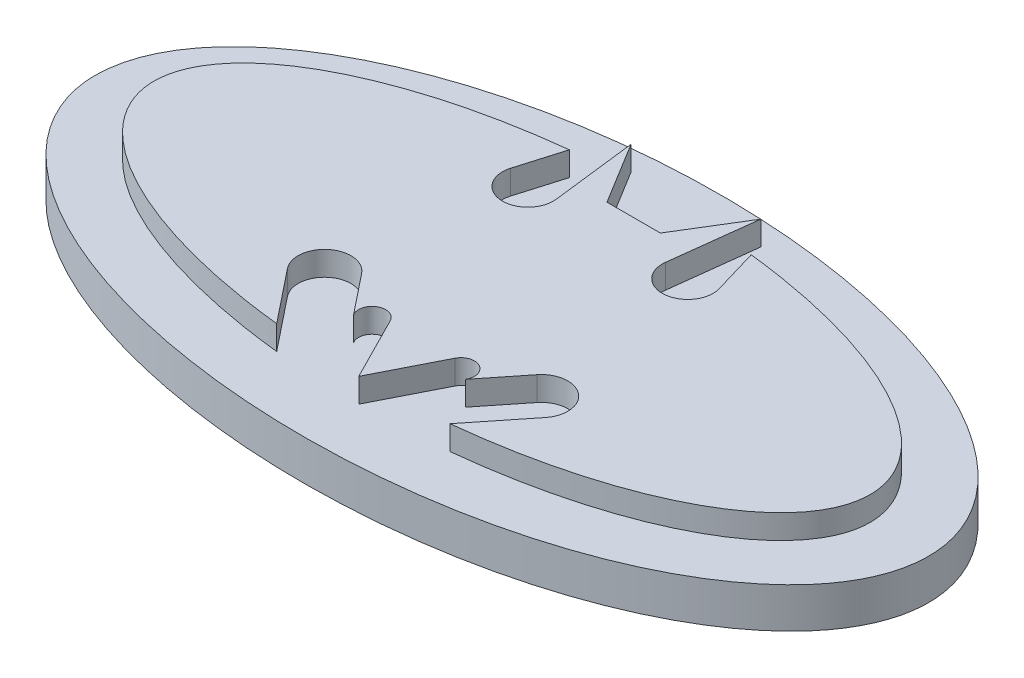
ISO-10303-21;
HEADER;
FILE_DESCRIPTION(('STEP AP214'),'2;1');
FILE_NAME('part.step','',(''),(''),'','','');
FILE_SCHEMA(('AUTOMOTIVE_DESIGN { 1 0 10303 214 1 1 1 1 }'));
ENDSEC;
DATA;
#1=APPLICATION_CONTEXT('core data for automotive mechanical design processes');
#2=APPLICATION_PROTOCOL_DEFINITION('international standard','automotive_design',2000,#1);
#3=PRODUCT_CONTEXT('',#1,'mechanical');
#4=PRODUCT('Part','Part','',(#3));
#5=PRODUCT_RELATED_PRODUCT_CATEGORY('part','',(#4));
#6=PRODUCT_DEFINITION_FORMATION('','',#4);
#7=PRODUCT_DEFINITION_CONTEXT('part definition',#1,'design');
#8=PRODUCT_DEFINITION('design','',#6,#7);
#9=PRODUCT_DEFINITION_SHAPE('','',#8);
#10=(LENGTH_UNIT() NAMED_UNIT(*) SI_UNIT(.MILLI.,.METRE.));
#11=(NAMED_UNIT(*) PLANE_ANGLE_UNIT() SI_UNIT($,.RADIAN.));
#12=(NAMED_UNIT(*) SI_UNIT($,.STERADIAN.) SOLID_ANGLE_UNIT());
#13=UNCERTAINTY_MEASURE_WITH_UNIT(LENGTH_MEASURE(1.E-05),#10,'distance_accuracy_value','');
#14=(GEOMETRIC_REPRESENTATION_CONTEXT(3) GLOBAL_UNCERTAINTY_ASSIGNED_CONTEXT((#13)) GLOBAL_UNIT_ASSIGNED_CONTEXT((#10,
#11,#12)) REPRESENTATION_CONTEXT('',''));
#15=CARTESIAN_POINT('',(0.,0.,0.));
#16=DIRECTION('',(0.,0.,1.));
#17=DIRECTION('',(1.,0.,0.));
#18=AXIS2_PLACEMENT_3D('',#15,#16,#17);
#19=CARTESIAN_POINT('',(0.,3.,0.));
#20=DIRECTION('',(0.,1.,0.));
#21=DIRECTION('',(-1.,0.,0.));
#22=AXIS2_PLACEMENT_3D('',#19,#20,#21);
#23=ELLIPSE('',#22,44.515994929944,19.0497422823864);
#24=DIRECTION('',(0.,-1.,0.));
#25=VECTOR('',#24,1.);
#26=SURFACE_OF_LINEAR_EXTRUSION('',#23,#25);
#27=CARTESIAN_POINT('',(0.,0.,0.));
#28=DIRECTION('',(0.,1.,0.));
#29=DIRECTION('',(-1.,0.,0.));
#30=AXIS2_PLACEMENT_3D('',#27,#28,#29);
#31=ELLIPSE('',#30,44.515994929944,19.0497422823864);
#32=CARTESIAN_POINT('',(10.7708977828334,0.,18.4837230522236));
#33=VERTEX_POINT('',#32);
#34=CARTESIAN_POINT('',(11.3044100683781,0.,-18.4252891604735));
#35=VERTEX_POINT('',#34);
#36=EDGE_CURVE('E183',#33,#35,#31,.T.);
#37=ORIENTED_EDGE('',*,*,#36,.T.);
#38=DIRECTION('',(0.,-1.,0.));
#39=VECTOR('',#38,1.);
#40=CARTESIAN_POINT('',(11.3044100683781,3.,-18.4252891604735));
#41=LINE('',#40,#39);
#42=CARTESIAN_POINT('',(11.3044100683781,3.,-18.4252891604735));
#43=VERTEX_POINT('',#42);
#44=EDGE_CURVE('E11',#43,#35,#41,.T.);
#45=ORIENTED_EDGE('',*,*,#44,.F.);
#46=CARTESIAN_POINT('',(10.7708977828334,3.,18.4837230522236));
#47=VERTEX_POINT('',#46);
#48=EDGE_CURVE('E282',#47,#43,#23,.T.);
#49=ORIENTED_EDGE('',*,*,#48,.F.);
#50=DIRECTION('',(0.,-1.,0.));
#51=VECTOR('',#50,1.);
#52=CARTESIAN_POINT('',(10.7708977828334,3.,18.4837230522236));
#53=LINE('',#52,#51);
#54=EDGE_CURVE('E198',#47,#33,#53,.T.);
#55=ORIENTED_EDGE('',*,*,#54,.T.);
#56=EDGE_LOOP('',(#37,#45,#49,#55));
#57=FACE_BOUND('',#56,.T.);
#58=ADVANCED_FACE('F39',(#57),#26,.F.);
#59=CARTESIAN_POINT('',(12.9651836572995,3.,-12.800088294772));
#60=DIRECTION('',(0.959074098796062,0.,-0.283155210120741));
#61=DIRECTION('',(-0.283155210120741,0.,-0.959074098796062));
#62=AXIS2_PLACEMENT_3D('',#59,#60,#61);
#63=PLANE('',#62);
#64=DIRECTION('',(0.283155210120741,0.,0.959074098796062));
#65=VECTOR('',#64,1.);
#66=CARTESIAN_POINT('',(12.9651836572995,0.,-12.800088294772));
#67=LINE('',#66,#65);
#68=CARTESIAN_POINT('',(12.9651836572995,0.,-12.800088294772));
#69=VERTEX_POINT('',#68);
#70=EDGE_CURVE('E179',#35,#69,#67,.T.);
#71=ORIENTED_EDGE('',*,*,#70,.T.);
#72=DIRECTION('',(0.,-1.,0.));
#73=VECTOR('',#72,1.);
#74=CARTESIAN_POINT('',(12.9651836572995,3.,-12.800088294772));
#75=LINE('',#74,#73);
#76=CARTESIAN_POINT('',(12.9651836572995,3.,-12.800088294772));
#77=VERTEX_POINT('',#76);
#78=EDGE_CURVE('E49',#77,#69,#75,.T.);
#79=ORIENTED_EDGE('',*,*,#78,.F.);
#80=DIRECTION('',(0.283155210120741,0.,0.959074098796062));
#81=VECTOR('',#80,1.);
#82=CARTESIAN_POINT('',(12.9651836572995,3.,-12.800088294772));
#83=LINE('',#82,#81);
#84=EDGE_CURVE('E194',#43,#77,#83,.T.);
#85=ORIENTED_EDGE('',*,*,#84,.F.);
#86=ORIENTED_EDGE('',*,*,#44,.T.);
#87=EDGE_LOOP('',(#71,#79,#85,#86));
#88=FACE_BOUND('',#87,.T.);
#89=ADVANCED_FACE('F193',(#88),#63,.F.);
#90=CARTESIAN_POINT('',(9.93125810118189,3.,-11.9043578924896));
#91=DIRECTION('',(0.,-1.,0.));
#92=DIRECTION('',(0.,0.,-1.));
#93=AXIS2_PLACEMENT_3D('',#90,#91,#92);
#94=CYLINDRICAL_SURFACE('',#93,3.16339014881759);
#95=CARTESIAN_POINT('',(9.93125810118189,0.,-11.9043578924896));
#96=DIRECTION('',(0.,-1.,0.));
#97=DIRECTION('',(0.,0.,1.));
#98=AXIS2_PLACEMENT_3D('',#95,#96,#97);
#99=CIRCLE('',#98,3.16339014881759);
#100=CARTESIAN_POINT('',(6.79057500967656,0.,-12.2827055532048));
#101=VERTEX_POINT('',#100);
#102=EDGE_CURVE('E186',#69,#101,#99,.T.);
#103=ORIENTED_EDGE('',*,*,#102,.T.);
#104=DIRECTION('',(0.,-1.,0.));
#105=VECTOR('',#104,1.);
#106=CARTESIAN_POINT('',(6.79057500967656,3.,-12.2827055532048));
#107=LINE('',#106,#105);
#108=CARTESIAN_POINT('',(6.79057500967656,3.,-12.2827055532048));
#109=VERTEX_POINT('',#108);
#110=EDGE_CURVE('E353',#109,#101,#107,.T.);
#111=ORIENTED_EDGE('',*,*,#110,.F.);
#112=CARTESIAN_POINT('',(9.93125810118189,3.,-11.9043578924896));
#113=DIRECTION('',(0.,-1.,0.));
#114=DIRECTION('',(0.,0.,1.));
#115=AXIS2_PLACEMENT_3D('',#112,#113,#114);
#116=CIRCLE('',#115,3.16339014881759);
#117=EDGE_CURVE('E361',#77,#109,#116,.T.);
#118=ORIENTED_EDGE('',*,*,#117,.F.);
#119=ORIENTED_EDGE('',*,*,#78,.T.);
#120=EDGE_LOOP('',(#103,#111,#118,#119));
#121=FACE_BOUND('',#120,.T.);
#122=ADVANCED_FACE('F359',(#121),#94,.F.);
#123=CARTESIAN_POINT('',(8.06490939048912,3.,-22.8610197819133));
#124=DIRECTION('',(-0.992821923239301,0.,-0.119601959580166));
#125=DIRECTION('',(-0.119601959580166,0.,0.992821923239301));
#126=AXIS2_PLACEMENT_3D('',#123,#124,#125);
#127=PLANE('',#126);
#128=DIRECTION('',(0.119601959580166,0.,-0.992821923239301));
#129=VECTOR('',#128,1.);
#130=CARTESIAN_POINT('',(8.06490939048912,0.,-22.8610197819133));
#131=LINE('',#130,#129);
#132=CARTESIAN_POINT('',(8.06490939048912,0.,-22.8610197819133));
#133=VERTEX_POINT('',#132);
#134=EDGE_CURVE('E211',#101,#133,#131,.T.);
#135=ORIENTED_EDGE('',*,*,#134,.T.);
#136=DIRECTION('',(0.,-1.,0.));
#137=VECTOR('',#136,1.);
#138=CARTESIAN_POINT('',(8.06490939048912,3.,-22.8610197819133));
#139=LINE('',#138,#137);
#140=CARTESIAN_POINT('',(8.06490939048912,3.,-22.8610197819133));
#141=VERTEX_POINT('',#140);
#142=EDGE_CURVE('E349',#141,#133,#139,.T.);
#143=ORIENTED_EDGE('',*,*,#142,.F.);
#144=DIRECTION('',(0.119601959580166,0.,-0.992821923239301));
#145=VECTOR('',#144,1.);
#146=CARTESIAN_POINT('',(8.06490939048912,3.,-22.8610197819133));
#147=LINE('',#146,#145);
#148=EDGE_CURVE('E364',#109,#141,#147,.T.);
#149=ORIENTED_EDGE('',*,*,#148,.F.);
#150=ORIENTED_EDGE('',*,*,#110,.T.);
#151=EDGE_LOOP('',(#135,#143,#149,#150));
#152=FACE_BOUND('',#151,.T.);
#153=ADVANCED_FACE('F426',(#152),#127,.F.);
#154=CARTESIAN_POINT('',(3.32168711735382,3.,-15.1220781783768));
#155=DIRECTION('',(0.852601252410943,0.,0.522562057929288));
#156=DIRECTION('',(0.522562057929288,0.,-0.852601252410943));
#157=AXIS2_PLACEMENT_3D('',#154,#155,#156);
#158=PLANE('',#157);
#159=DIRECTION('',(-0.522562057929288,0.,0.852601252410943));
#160=VECTOR('',#159,1.);
#161=CARTESIAN_POINT('',(3.32168711735382,0.,-15.1220781783768));
#162=LINE('',#161,#160);
#163=CARTESIAN_POINT('',(3.32168711735382,0.,-15.1220781783768));
#164=VERTEX_POINT('',#163);
#165=EDGE_CURVE('E215',#133,#164,#162,.T.);
#166=ORIENTED_EDGE('',*,*,#165,.T.);
#167=DIRECTION('',(0.,-1.,0.));
#168=VECTOR('',#167,1.);
#169=CARTESIAN_POINT('',(3.32168711735382,3.,-15.1220781783768));
#170=LINE('',#169,#168);
#171=CARTESIAN_POINT('',(3.32168711735382,3.,-15.1220781783768));
#172=VERTEX_POINT('',#171);
#173=EDGE_CURVE('E345',#172,#164,#170,.T.);
#174=ORIENTED_EDGE('',*,*,#173,.F.);
#175=DIRECTION('',(-0.522562057929288,0.,0.852601252410943));
#176=VECTOR('',#175,1.);
#177=CARTESIAN_POINT('',(3.32168711735382,3.,-15.1220781783768));
#178=LINE('',#177,#176);
#179=EDGE_CURVE('E368',#141,#172,#178,.T.);
#180=ORIENTED_EDGE('',*,*,#179,.F.);
#181=ORIENTED_EDGE('',*,*,#142,.T.);
#182=EDGE_LOOP('',(#166,#174,#180,#181));
#183=FACE_BOUND('',#182,.T.);
#184=ADVANCED_FACE('F422',(#183),#158,.F.);
#185=CARTESIAN_POINT('',(-3.32168711735382,3.,-15.1220781783768));
#186=DIRECTION('',(0.,0.,1.));
#187=DIRECTION('',(1.,0.,0.));
#188=AXIS2_PLACEMENT_3D('',#185,#186,#187);
#189=PLANE('',#188);
#190=DIRECTION('',(-1.,0.,0.));
#191=VECTOR('',#190,1.);
#192=CARTESIAN_POINT('',(-3.32168711735382,0.,-15.1220781783768));
#193=LINE('',#192,#191);
#194=CARTESIAN_POINT('',(-3.32168711735382,0.,-15.1220781783768));
#195=VERTEX_POINT('',#194);
#196=EDGE_CURVE('E219',#164,#195,#193,.T.);
#197=ORIENTED_EDGE('',*,*,#196,.T.);
#198=DIRECTION('',(0.,-1.,0.));
#199=VECTOR('',#198,1.);
#200=CARTESIAN_POINT('',(-3.32168711735382,3.,-15.1220781783768));
#201=LINE('',#200,#199);
#202=CARTESIAN_POINT('',(-3.32168711735382,3.,-15.1220781783768));
#203=VERTEX_POINT('',#202);
#204=EDGE_CURVE('E341',#203,#195,#201,.T.);
#205=ORIENTED_EDGE('',*,*,#204,.F.);
#206=DIRECTION('',(-1.,0.,0.));
#207=VECTOR('',#206,1.);
#208=CARTESIAN_POINT('',(-3.32168711735382,3.,-15.1220781783768));
#209=LINE('',#208,#207);
#210=EDGE_CURVE('E374',#172,#203,#209,.T.);
#211=ORIENTED_EDGE('',*,*,#210,.F.);
#212=ORIENTED_EDGE('',*,*,#173,.T.);
#213=EDGE_LOOP('',(#197,#205,#211,#212));
#214=FACE_BOUND('',#213,.T.);
#215=ADVANCED_FACE('F418',(#214),#189,.F.);
#216=CARTESIAN_POINT('',(-3.32168711735382,3.,-15.1220781783768));
#217=DIRECTION('',(-0.852601252410943,0.,0.522562057929288));
#218=DIRECTION('',(0.522562057929288,0.,0.852601252410943));
#219=AXIS2_PLACEMENT_3D('',#216,#217,#218);
#220=PLANE('',#219);
#221=DIRECTION('',(-0.522562057929288,0.,-0.852601252410943));
#222=VECTOR('',#221,1.);
#223=CARTESIAN_POINT('',(-3.32168711735382,0.,-15.1220781783768));
#224=LINE('',#223,#222);
#225=CARTESIAN_POINT('',(-8.06490939048912,0.,-22.8610197819133));
#226=VERTEX_POINT('',#225);
#227=EDGE_CURVE('E223',#195,#226,#224,.T.);
#228=ORIENTED_EDGE('',*,*,#227,.T.);
#229=DIRECTION('',(0.,-1.,0.));
#230=VECTOR('',#229,1.);
#231=CARTESIAN_POINT('',(-8.06490939048912,3.,-22.8610197819133));
#232=LINE('',#231,#230);
#233=CARTESIAN_POINT('',(-8.06490939048912,3.,-22.8610197819133));
#234=VERTEX_POINT('',#233);
#235=EDGE_CURVE('E337',#234,#226,#232,.T.);
#236=ORIENTED_EDGE('',*,*,#235,.F.);
#237=DIRECTION('',(-0.522562057929288,0.,-0.852601252410943));
#238=VECTOR('',#237,1.);
#239=CARTESIAN_POINT('',(-3.32168711735382,3.,-15.1220781783768));
#240=LINE('',#239,#238);
#241=EDGE_CURVE('E377',#203,#234,#240,.T.);
#242=ORIENTED_EDGE('',*,*,#241,.F.);
#243=ORIENTED_EDGE('',*,*,#204,.T.);
#244=EDGE_LOOP('',(#228,#236,#242,#243));
#245=FACE_BOUND('',#244,.T.);
#246=ADVANCED_FACE('F414',(#245),#220,.F.);
#247=CARTESIAN_POINT('',(-8.06490939048912,3.,-22.8610197819133));
#248=DIRECTION('',(0.992821923239301,0.,-0.119601959580166));
#249=DIRECTION('',(-0.119601959580166,0.,-0.992821923239301));
#250=AXIS2_PLACEMENT_3D('',#247,#248,#249);
#251=PLANE('',#250);
#252=DIRECTION('',(0.119601959580166,0.,0.992821923239301));
#253=VECTOR('',#252,1.);
#254=CARTESIAN_POINT('',(-8.06490939048912,0.,-22.8610197819133));
#255=LINE('',#254,#253);
#256=CARTESIAN_POINT('',(-6.79057500967656,0.,-12.2827055532048));
#257=VERTEX_POINT('',#256);
#258=EDGE_CURVE('E227',#226,#257,#255,.T.);
#259=ORIENTED_EDGE('',*,*,#258,.T.);
#260=DIRECTION('',(0.,-1.,0.));
#261=VECTOR('',#260,1.);
#262=CARTESIAN_POINT('',(-6.79057500967656,3.,-12.2827055532048));
#263=LINE('',#262,#261);
#264=CARTESIAN_POINT('',(-6.79057500967656,3.,-12.2827055532048));
#265=VERTEX_POINT('',#264);
#266=EDGE_CURVE('E333',#265,#257,#263,.T.);
#267=ORIENTED_EDGE('',*,*,#266,.F.);
#268=DIRECTION('',(0.119601959580166,0.,0.992821923239301));
#269=VECTOR('',#268,1.);
#270=CARTESIAN_POINT('',(-8.06490939048912,3.,-22.8610197819133));
#271=LINE('',#270,#269);
#272=EDGE_CURVE('E380',#234,#265,#271,.T.);
#273=ORIENTED_EDGE('',*,*,#272,.F.);
#274=ORIENTED_EDGE('',*,*,#235,.T.);
#275=EDGE_LOOP('',(#259,#267,#273,#274));
#276=FACE_BOUND('',#275,.T.);
#277=ADVANCED_FACE('F410',(#276),#251,.F.);
#278=CARTESIAN_POINT('',(-9.93125810118189,3.,-11.9043578924896));
#279=DIRECTION('',(0.,-1.,0.));
#280=DIRECTION('',(0.,0.,-1.));
#281=AXIS2_PLACEMENT_3D('',#278,#279,#280);
#282=CYLINDRICAL_SURFACE('',#281,3.16339014881759);
#283=CARTESIAN_POINT('',(-9.93125810118189,0.,-11.9043578924896));
#284=DIRECTION('',(0.,-1.,0.));
#285=DIRECTION('',(0.,0.,-1.));
#286=AXIS2_PLACEMENT_3D('',#283,#284,#285);
#287=CIRCLE('',#286,3.16339014881759);
#288=CARTESIAN_POINT('',(-12.9651836572995,0.,-12.800088294772));
#289=VERTEX_POINT('',#288);
#290=EDGE_CURVE('E231',#257,#289,#287,.T.);
#291=ORIENTED_EDGE('',*,*,#290,.T.);
#292=DIRECTION('',(0.,-1.,0.));
#293=VECTOR('',#292,1.);
#294=CARTESIAN_POINT('',(-12.9651836572995,3.,-12.800088294772));
#295=LINE('',#294,#293);
#296=CARTESIAN_POINT('',(-12.9651836572995,3.,-12.800088294772));
#297=VERTEX_POINT('',#296);
#298=EDGE_CURVE('E329',#297,#289,#295,.T.);
#299=ORIENTED_EDGE('',*,*,#298,.F.);
#300=CARTESIAN_POINT('',(-9.93125810118189,3.,-11.9043578924896));
#301=DIRECTION('',(0.,-1.,0.));
#302=DIRECTION('',(0.,0.,-1.));
#303=AXIS2_PLACEMENT_3D('',#300,#301,#302);
#304=CIRCLE('',#303,3.16339014881759);
#305=EDGE_CURVE('E383',#265,#297,#304,.T.);
#306=ORIENTED_EDGE('',*,*,#305,.F.);
#307=ORIENTED_EDGE('',*,*,#266,.T.);
#308=EDGE_LOOP('',(#291,#299,#306,#307));
#309=FACE_BOUND('',#308,.T.);
#310=ADVANCED_FACE('F406',(#309),#282,.F.);
#311=CARTESIAN_POINT('',(-12.9651836572995,3.,-12.800088294772));
#312=DIRECTION('',(-0.959074098796062,0.,-0.283155210120741));
#313=DIRECTION('',(-0.283155210120741,0.,0.959074098796062));
#314=AXIS2_PLACEMENT_3D('',#311,#312,#313);
#315=PLANE('',#314);
#316=DIRECTION('',(0.283155210120741,0.,-0.959074098796062));
#317=VECTOR('',#316,1.);
#318=CARTESIAN_POINT('',(-12.9651836572995,0.,-12.800088294772));
#319=LINE('',#318,#317);
#320=CARTESIAN_POINT('',(-11.3044100683781,0.,-18.4252891604735));
#321=VERTEX_POINT('',#320);
#322=EDGE_CURVE('E235',#289,#321,#319,.T.);
#323=ORIENTED_EDGE('',*,*,#322,.T.);
#324=DIRECTION('',(0.,-1.,0.));
#325=VECTOR('',#324,1.);
#326=CARTESIAN_POINT('',(-11.3044100683781,3.,-18.4252891604735));
#327=LINE('',#326,#325);
#328=CARTESIAN_POINT('',(-11.3044100683781,3.,-18.4252891604735));
#329=VERTEX_POINT('',#328);
#330=EDGE_CURVE('E325',#329,#321,#327,.T.);
#331=ORIENTED_EDGE('',*,*,#330,.F.);
#332=DIRECTION('',(0.283155210120741,0.,-0.959074098796062));
#333=VECTOR('',#332,1.);
#334=CARTESIAN_POINT('',(-12.9651836572995,3.,-12.800088294772));
#335=LINE('',#334,#333);
#336=EDGE_CURVE('E386',#297,#329,#335,.T.);
#337=ORIENTED_EDGE('',*,*,#336,.F.);
#338=ORIENTED_EDGE('',*,*,#298,.T.);
#339=EDGE_LOOP('',(#323,#331,#337,#338));
#340=FACE_BOUND('',#339,.T.);
#341=ADVANCED_FACE('F401',(#340),#315,.F.);
#342=CARTESIAN_POINT('',(0.,3.,0.));
#343=DIRECTION('',(0.,1.,0.));
#344=DIRECTION('',(1.,0.,0.));
#345=AXIS2_PLACEMENT_3D('',#342,#343,#344);
#346=ELLIPSE('',#345,44.515994929944,19.0497422823864);
#347=DIRECTION('',(0.,-1.,0.));
#348=VECTOR('',#347,1.);
#349=SURFACE_OF_LINEAR_EXTRUSION('',#346,#348);
#350=CARTESIAN_POINT('',(0.,0.,0.));
#351=DIRECTION('',(0.,1.,0.));
#352=DIRECTION('',(1.,0.,0.));
#353=AXIS2_PLACEMENT_3D('',#350,#351,#352);
#354=ELLIPSE('',#353,44.515994929944,19.0497422823864);
#355=CARTESIAN_POINT('',(-10.7708977828334,0.,18.4837230522236));
#356=VERTEX_POINT('',#355);
#357=EDGE_CURVE('E239',#321,#356,#354,.T.);
#358=ORIENTED_EDGE('',*,*,#357,.T.);
#359=DIRECTION('',(0.,-1.,0.));
#360=VECTOR('',#359,1.);
#361=CARTESIAN_POINT('',(-10.7708977828334,3.,18.4837230522236));
#362=LINE('',#361,#360);
#363=CARTESIAN_POINT('',(-10.7708977828334,3.,18.4837230522236));
#364=VERTEX_POINT('',#363);
#365=EDGE_CURVE('E321',#364,#356,#362,.T.);
#366=ORIENTED_EDGE('',*,*,#365,.F.);
#367=EDGE_CURVE('E389',#329,#364,#346,.T.);
#368=ORIENTED_EDGE('',*,*,#367,.F.);
#369=ORIENTED_EDGE('',*,*,#330,.T.);
#370=EDGE_LOOP('',(#358,#366,#368,#369));
#371=FACE_BOUND('',#370,.T.);
#372=ADVANCED_FACE('F396',(#371),#349,.F.);
#373=CARTESIAN_POINT('',(-16.0423612364748,3.,11.8746199933218));
#374=DIRECTION('',(-0.781780758645211,0.,0.62355340221357));
#375=DIRECTION('',(0.62355340221357,0.,0.781780758645211));
#376=AXIS2_PLACEMENT_3D('',#373,#374,#375);
#377=PLANE('',#376);
#378=DIRECTION('',(-0.62355340221357,0.,-0.781780758645211));
#379=VECTOR('',#378,1.);
#380=CARTESIAN_POINT('',(-16.0423612364748,0.,11.8746199933218));
#381=LINE('',#380,#379);
#382=CARTESIAN_POINT('',(-16.0423612364748,0.,11.8746199933218));
#383=VERTEX_POINT('',#382);
#384=EDGE_CURVE('E243',#356,#383,#381,.T.);
#385=ORIENTED_EDGE('',*,*,#384,.T.);
#386=DIRECTION('',(0.,-1.,0.));
#387=VECTOR('',#386,1.);
#388=CARTESIAN_POINT('',(-16.0423612364748,3.,11.8746199933218));
#389=LINE('',#388,#387);
#390=CARTESIAN_POINT('',(-16.0423612364748,3.,11.8746199933218));
#391=VERTEX_POINT('',#390);
#392=EDGE_CURVE('E317',#391,#383,#389,.T.);
#393=ORIENTED_EDGE('',*,*,#392,.F.);
#394=DIRECTION('',(-0.62355340221357,0.,-0.781780758645211));
#395=VECTOR('',#394,1.);
#396=CARTESIAN_POINT('',(-16.0423612364748,3.,11.8746199933218));
#397=LINE('',#396,#395);
#398=EDGE_CURVE('E393',#364,#391,#397,.T.);
#399=ORIENTED_EDGE('',*,*,#398,.F.);
#400=ORIENTED_EDGE('',*,*,#365,.T.);
#401=EDGE_LOOP('',(#385,#393,#399,#400));
#402=FACE_BOUND('',#401,.T.);
#403=ADVANCED_FACE('F400',(#402),#377,.F.);
#404=CARTESIAN_POINT('',(-13.4769105569766,3.,9.82839989680217));
#405=DIRECTION('',(0.,-1.,0.));
#406=DIRECTION('',(0.,0.,-1.));
#407=AXIS2_PLACEMENT_3D('',#404,#405,#406);
#408=CYLINDRICAL_SURFACE('',#407,3.2815474813476);
#409=CARTESIAN_POINT('',(-13.4769105569766,0.,9.82839989680217));
#410=DIRECTION('',(0.,-1.,0.));
#411=DIRECTION('',(0.,0.,1.));
#412=AXIS2_PLACEMENT_3D('',#409,#410,#411);
#413=CIRCLE('',#412,3.2815474813476);
#414=CARTESIAN_POINT('',(-10.9114598774784,0.,7.7821798002825));
#415=VERTEX_POINT('',#414);
#416=EDGE_CURVE('E247',#383,#415,#413,.T.);
#417=ORIENTED_EDGE('',*,*,#416,.T.);
#418=DIRECTION('',(0.,-1.,0.));
#419=VECTOR('',#418,1.);
#420=CARTESIAN_POINT('',(-10.9114598774784,3.,7.7821798002825));
#421=LINE('',#420,#419);
#422=CARTESIAN_POINT('',(-10.9114598774784,3.,7.7821798002825));
#423=VERTEX_POINT('',#422);
#424=EDGE_CURVE('E313',#423,#415,#421,.T.);
#425=ORIENTED_EDGE('',*,*,#424,.F.);
#426=CARTESIAN_POINT('',(-13.4769105569766,3.,9.82839989680217));
#427=DIRECTION('',(0.,-1.,0.));
#428=DIRECTION('',(0.,0.,1.));
#429=AXIS2_PLACEMENT_3D('',#426,#427,#428);
#430=CIRCLE('',#429,3.2815474813476);
#431=EDGE_CURVE('E666',#391,#423,#430,.T.);
#432=ORIENTED_EDGE('',*,*,#431,.F.);
#433=ORIENTED_EDGE('',*,*,#392,.T.);
#434=EDGE_LOOP('',(#417,#425,#432,#433));
#435=FACE_BOUND('',#434,.T.);
#436=ADVANCED_FACE('F510',(#435),#408,.F.);
#437=CARTESIAN_POINT('',(-6.95130401420753,3.,12.7472295364409));
#438=DIRECTION('',(0.781780758645211,0.,-0.62355340221357));
#439=DIRECTION('',(-0.623553402213571,0.,-0.781780758645211));
#440=AXIS2_PLACEMENT_3D('',#437,#438,#439);
#441=PLANE('',#440);
#442=DIRECTION('',(0.623553402213571,0.,0.781780758645211));
#443=VECTOR('',#442,1.);
#444=CARTESIAN_POINT('',(-6.95130401420753,0.,12.7472295364409));
#445=LINE('',#444,#443);
#446=CARTESIAN_POINT('',(-6.95130401420753,0.,12.7472295364409));
#447=VERTEX_POINT('',#446);
#448=EDGE_CURVE('E251',#415,#447,#445,.T.);
#449=ORIENTED_EDGE('',*,*,#448,.T.);
#450=DIRECTION('',(0.,-1.,0.));
#451=VECTOR('',#450,1.);
#452=CARTESIAN_POINT('',(-6.95130401420753,3.,12.7472295364409));
#453=LINE('',#452,#451);
#454=CARTESIAN_POINT('',(-6.95130401420753,3.,12.7472295364409));
#455=VERTEX_POINT('',#454);
#456=EDGE_CURVE('E309',#455,#447,#453,.T.);
#457=ORIENTED_EDGE('',*,*,#456,.F.);
#458=DIRECTION('',(0.623553402213571,0.,0.781780758645211));
#459=VECTOR('',#458,1.);
#460=CARTESIAN_POINT('',(-6.95130401420753,3.,12.7472295364409));
#461=LINE('',#460,#459);
#462=EDGE_CURVE('E664',#423,#455,#461,.T.);
#463=ORIENTED_EDGE('',*,*,#462,.F.);
#464=ORIENTED_EDGE('',*,*,#424,.T.);
#465=EDGE_LOOP('',(#449,#457,#463,#464));
#466=FACE_BOUND('',#465,.T.);
#467=ADVANCED_FACE('F519',(#466),#441,.F.);
#468=CARTESIAN_POINT('',(-5.52026816979852,3.,11.8746199933218));
#469=DIRECTION('',(0.,-1.,0.));
#470=DIRECTION('',(0.,0.,-1.));
#471=AXIS2_PLACEMENT_3D('',#468,#469,#470);
#472=CYLINDRICAL_SURFACE('',#471,1.67609993816774);
#473=CARTESIAN_POINT('',(-5.52026816979852,0.,11.8746199933218));
#474=DIRECTION('',(0.,-1.,0.));
#475=DIRECTION('',(0.,0.,1.));
#476=AXIS2_PLACEMENT_3D('',#473,#474,#475);
#477=CIRCLE('',#476,1.67609993816774);
#478=CARTESIAN_POINT('',(-4.02557644264857,0.,11.1161955451957));
#479=VERTEX_POINT('',#478);
#480=EDGE_CURVE('E255',#447,#479,#477,.T.);
#481=ORIENTED_EDGE('',*,*,#480,.T.);
#482=DIRECTION('',(0.,-1.,0.));
#483=VECTOR('',#482,1.);
#484=CARTESIAN_POINT('',(-4.02557644264857,3.,11.1161955451957));
#485=LINE('',#484,#483);
#486=CARTESIAN_POINT('',(-4.02557644264857,3.,11.1161955451957));
#487=VERTEX_POINT('',#486);
#488=EDGE_CURVE('E305',#487,#479,#485,.T.);
#489=ORIENTED_EDGE('',*,*,#488,.F.);
#490=CARTESIAN_POINT('',(-5.52026816979852,3.,11.8746199933218));
#491=DIRECTION('',(0.,-1.,0.));
#492=DIRECTION('',(0.,0.,1.));
#493=AXIS2_PLACEMENT_3D('',#490,#491,#492);
#494=CIRCLE('',#493,1.67609993816774);
#495=EDGE_CURVE('E660',#455,#487,#494,.T.);
#496=ORIENTED_EDGE('',*,*,#495,.F.);
#497=ORIENTED_EDGE('',*,*,#456,.T.);
#498=EDGE_LOOP('',(#481,#489,#496,#497));
#499=FACE_BOUND('',#498,.T.);
#500=ADVANCED_FACE('F528',(#499),#472,.F.);
#501=CARTESIAN_POINT('',(0.,3.,19.0497422823864));
#502=DIRECTION('',(0.891767664393511,0.,-0.45249357204511));
#503=DIRECTION('',(-0.45249357204511,0.,-0.891767664393511));
#504=AXIS2_PLACEMENT_3D('',#501,#502,#503);
#505=PLANE('',#504);
#506=DIRECTION('',(0.45249357204511,0.,0.891767664393511));
#507=VECTOR('',#506,1.);
#508=CARTESIAN_POINT('',(0.,0.,19.0497422823864));
#509=LINE('',#508,#507);
#510=CARTESIAN_POINT('',(0.,0.,19.0497422823864));
#511=VERTEX_POINT('',#510);
#512=EDGE_CURVE('E259',#479,#511,#509,.T.);
#513=ORIENTED_EDGE('',*,*,#512,.T.);
#514=DIRECTION('',(0.,-1.,0.));
#515=VECTOR('',#514,1.);
#516=CARTESIAN_POINT('',(0.,3.,19.0497422823864));
#517=LINE('',#516,#515);
#518=CARTESIAN_POINT('',(0.,3.,19.0497422823864));
#519=VERTEX_POINT('',#518);
#520=EDGE_CURVE('E301',#519,#511,#517,.T.);
#521=ORIENTED_EDGE('',*,*,#520,.F.);
#522=DIRECTION('',(0.45249357204511,0.,0.891767664393511));
#523=VECTOR('',#522,1.);
#524=CARTESIAN_POINT('',(0.,3.,19.0497422823864));
#525=LINE('',#524,#523);
#526=EDGE_CURVE('E658',#487,#519,#525,.T.);
#527=ORIENTED_EDGE('',*,*,#526,.F.);
#528=ORIENTED_EDGE('',*,*,#488,.T.);
#529=EDGE_LOOP('',(#513,#521,#527,#528));
#530=FACE_BOUND('',#529,.T.);
#531=ADVANCED_FACE('F538',(#530),#505,.F.);
#532=CARTESIAN_POINT('',(0.,3.,19.0497422823864));
#533=DIRECTION('',(-0.89176766439351,0.,-0.45249357204511));
#534=DIRECTION('',(-0.45249357204511,0.,0.89176766439351));
#535=AXIS2_PLACEMENT_3D('',#532,#533,#534);
#536=PLANE('',#535);
#537=DIRECTION('',(0.45249357204511,0.,-0.891767664393511));
#538=VECTOR('',#537,1.);
#539=CARTESIAN_POINT('',(0.,0.,19.0497422823864));
#540=LINE('',#539,#538);
#541=CARTESIAN_POINT('',(4.02557644264857,0.,11.1161955451957));
#542=VERTEX_POINT('',#541);
#543=EDGE_CURVE('E263',#511,#542,#540,.T.);
#544=ORIENTED_EDGE('',*,*,#543,.T.);
#545=DIRECTION('',(0.,-1.,0.));
#546=VECTOR('',#545,1.);
#547=CARTESIAN_POINT('',(4.02557644264857,3.,11.1161955451957));
#548=LINE('',#547,#546);
#549=CARTESIAN_POINT('',(4.02557644264857,3.,11.1161955451957));
#550=VERTEX_POINT('',#549);
#551=EDGE_CURVE('E297',#550,#542,#548,.T.);
#552=ORIENTED_EDGE('',*,*,#551,.F.);
#553=DIRECTION('',(0.45249357204511,0.,-0.891767664393511));
#554=VECTOR('',#553,1.);
#555=CARTESIAN_POINT('',(0.,3.,19.0497422823864));
#556=LINE('',#555,#554);
#557=EDGE_CURVE('E654',#519,#550,#556,.T.);
#558=ORIENTED_EDGE('',*,*,#557,.F.);
#559=ORIENTED_EDGE('',*,*,#520,.T.);
#560=EDGE_LOOP('',(#544,#552,#558,#559));
#561=FACE_BOUND('',#560,.T.);
#562=ADVANCED_FACE('F548',(#561),#536,.F.);
#563=CARTESIAN_POINT('',(5.52026816979852,3.,11.8746199933218));
#564=DIRECTION('',(0.,-1.,0.));
#565=DIRECTION('',(0.,0.,-1.));
#566=AXIS2_PLACEMENT_3D('',#563,#564,#565);
#567=CYLINDRICAL_SURFACE('',#566,1.67609993816774);
#568=CARTESIAN_POINT('',(5.52026816979852,0.,11.8746199933218));
#569=DIRECTION('',(0.,-1.,0.));
#570=DIRECTION('',(0.,0.,-1.));
#571=AXIS2_PLACEMENT_3D('',#568,#569,#570);
#572=CIRCLE('',#571,1.67609993816774);
#573=CARTESIAN_POINT('',(6.95130401420753,0.,12.7472295364409));
#574=VERTEX_POINT('',#573);
#575=EDGE_CURVE('E267',#542,#574,#572,.T.);
#576=ORIENTED_EDGE('',*,*,#575,.T.);
#577=DIRECTION('',(0.,-1.,0.));
#578=VECTOR('',#577,1.);
#579=CARTESIAN_POINT('',(6.95130401420753,3.,12.7472295364409));
#580=LINE('',#579,#578);
#581=CARTESIAN_POINT('',(6.95130401420753,3.,12.7472295364409));
#582=VERTEX_POINT('',#581);
#583=EDGE_CURVE('E293',#582,#574,#580,.T.);
#584=ORIENTED_EDGE('',*,*,#583,.F.);
#585=CARTESIAN_POINT('',(5.52026816979852,3.,11.8746199933218));
#586=DIRECTION('',(0.,-1.,0.));
#587=DIRECTION('',(0.,0.,-1.));
#588=AXIS2_PLACEMENT_3D('',#585,#586,#587);
#589=CIRCLE('',#588,1.67609993816774);
#590=EDGE_CURVE('E652',#550,#582,#589,.T.);
#591=ORIENTED_EDGE('',*,*,#590,.F.);
#592=ORIENTED_EDGE('',*,*,#551,.T.);
#593=EDGE_LOOP('',(#576,#584,#591,#592));
#594=FACE_BOUND('',#593,.T.);
#595=ADVANCED_FACE('F558',(#594),#567,.F.);
#596=CARTESIAN_POINT('',(6.95130401420753,3.,12.7472295364409));
#597=DIRECTION('',(-0.781780758645211,0.,-0.62355340221357));
#598=DIRECTION('',(-0.623553402213571,0.,0.781780758645211));
#599=AXIS2_PLACEMENT_3D('',#596,#597,#598);
#600=PLANE('',#599);
#601=DIRECTION('',(0.623553402213571,0.,-0.781780758645211));
#602=VECTOR('',#601,1.);
#603=CARTESIAN_POINT('',(6.95130401420753,0.,12.7472295364409));
#604=LINE('',#603,#602);
#605=CARTESIAN_POINT('',(10.9114598774784,0.,7.7821798002825));
#606=VERTEX_POINT('',#605);
#607=EDGE_CURVE('E271',#574,#606,#604,.T.);
#608=ORIENTED_EDGE('',*,*,#607,.T.);
#609=DIRECTION('',(0.,-1.,0.));
#610=VECTOR('',#609,1.);
#611=CARTESIAN_POINT('',(10.9114598774784,3.,7.7821798002825));
#612=LINE('',#611,#610);
#613=CARTESIAN_POINT('',(10.9114598774784,3.,7.7821798002825));
#614=VERTEX_POINT('',#613);
#615=EDGE_CURVE('E289',#614,#606,#612,.T.);
#616=ORIENTED_EDGE('',*,*,#615,.F.);
#617=DIRECTION('',(0.623553402213571,0.,-0.781780758645211));
#618=VECTOR('',#617,1.);
#619=CARTESIAN_POINT('',(6.95130401420753,3.,12.7472295364409));
#620=LINE('',#619,#618);
#621=EDGE_CURVE('E648',#582,#614,#620,.T.);
#622=ORIENTED_EDGE('',*,*,#621,.F.);
#623=ORIENTED_EDGE('',*,*,#583,.T.);
#624=EDGE_LOOP('',(#608,#616,#622,#623));
#625=FACE_BOUND('',#624,.T.);
#626=ADVANCED_FACE('F568',(#625),#600,.F.);
#627=CARTESIAN_POINT('',(13.4769105569766,3.,9.82839989680217));
#628=DIRECTION('',(0.,-1.,0.));
#629=DIRECTION('',(0.,0.,-1.));
#630=AXIS2_PLACEMENT_3D('',#627,#628,#629);
#631=CYLINDRICAL_SURFACE('',#630,3.2815474813476);
#632=CARTESIAN_POINT('',(13.4769105569766,0.,9.82839989680217));
#633=DIRECTION('',(0.,-1.,0.));
#634=DIRECTION('',(0.,0.,-1.));
#635=AXIS2_PLACEMENT_3D('',#632,#633,#634);
#636=CIRCLE('',#635,3.2815474813476);
#637=CARTESIAN_POINT('',(16.0423612364748,0.,11.8746199933218));
#638=VERTEX_POINT('',#637);
#639=EDGE_CURVE('E275',#606,#638,#636,.T.);
#640=ORIENTED_EDGE('',*,*,#639,.T.);
#641=DIRECTION('',(0.,-1.,0.));
#642=VECTOR('',#641,1.);
#643=CARTESIAN_POINT('',(16.0423612364748,3.,11.8746199933218));
#644=LINE('',#643,#642);
#645=CARTESIAN_POINT('',(16.0423612364748,3.,11.8746199933218));
#646=VERTEX_POINT('',#645);
#647=EDGE_CURVE('E285',#646,#638,#644,.T.);
#648=ORIENTED_EDGE('',*,*,#647,.F.);
#649=CARTESIAN_POINT('',(13.4769105569766,3.,9.82839989680217));
#650=DIRECTION('',(0.,-1.,0.));
#651=DIRECTION('',(0.,0.,-1.));
#652=AXIS2_PLACEMENT_3D('',#649,#650,#651);
#653=CIRCLE('',#652,3.2815474813476);
#654=EDGE_CURVE('E646',#614,#646,#653,.T.);
#655=ORIENTED_EDGE('',*,*,#654,.F.);
#656=ORIENTED_EDGE('',*,*,#615,.T.);
#657=EDGE_LOOP('',(#640,#648,#655,#656));
#658=FACE_BOUND('',#657,.T.);
#659=ADVANCED_FACE('F578',(#658),#631,.F.);
#660=CARTESIAN_POINT('',(16.0423612364748,3.,11.8746199933218));
#661=DIRECTION('',(0.781780758645211,0.,0.62355340221357));
#662=DIRECTION('',(0.62355340221357,0.,-0.781780758645211));
#663=AXIS2_PLACEMENT_3D('',#660,#661,#662);
#664=PLANE('',#663);
#665=DIRECTION('',(-0.62355340221357,0.,0.781780758645211));
#666=VECTOR('',#665,1.);
#667=CARTESIAN_POINT('',(16.0423612364748,0.,11.8746199933218));
#668=LINE('',#667,#666);
#669=EDGE_CURVE('E279',#638,#33,#668,.T.);
#670=ORIENTED_EDGE('',*,*,#669,.T.);
#671=ORIENTED_EDGE('',*,*,#54,.F.);
#672=DIRECTION('',(-0.62355340221357,0.,0.781780758645211));
#673=VECTOR('',#672,1.);
#674=CARTESIAN_POINT('',(16.0423612364748,3.,11.8746199933218));
#675=LINE('',#674,#673);
#676=EDGE_CURVE('E56',#646,#47,#675,.T.);
#677=ORIENTED_EDGE('',*,*,#676,.F.);
#678=ORIENTED_EDGE('',*,*,#647,.T.);
#679=EDGE_LOOP('',(#670,#671,#677,#678));
#680=FACE_BOUND('',#679,.T.);
#681=ADVANCED_FACE('F588',(#680),#664,.F.);
#682=CARTESIAN_POINT('',(0.,3.,0.));
#683=DIRECTION('',(0.,1.,0.));
#684=DIRECTION('',(0.,0.,1.));
#685=AXIS2_PLACEMENT_3D('',#682,#683,#684);
#686=PLANE('',#685);
#687=ORIENTED_EDGE('',*,*,#48,.T.);
#688=ORIENTED_EDGE('',*,*,#84,.T.);
#689=ORIENTED_EDGE('',*,*,#117,.T.);
#690=ORIENTED_EDGE('',*,*,#148,.T.);
#691=ORIENTED_EDGE('',*,*,#179,.T.);
#692=ORIENTED_EDGE('',*,*,#210,.T.);
#693=ORIENTED_EDGE('',*,*,#241,.T.);
#694=ORIENTED_EDGE('',*,*,#272,.T.);
#695=ORIENTED_EDGE('',*,*,#305,.T.);
#696=ORIENTED_EDGE('',*,*,#336,.T.);
#697=ORIENTED_EDGE('',*,*,#367,.T.);
#698=ORIENTED_EDGE('',*,*,#398,.T.);
#699=ORIENTED_EDGE('',*,*,#431,.T.);
#700=ORIENTED_EDGE('',*,*,#462,.T.);
#701=ORIENTED_EDGE('',*,*,#495,.T.);
#702=ORIENTED_EDGE('',*,*,#526,.T.);
#703=ORIENTED_EDGE('',*,*,#557,.T.);
#704=ORIENTED_EDGE('',*,*,#590,.T.);
#705=ORIENTED_EDGE('',*,*,#621,.T.);
#706=ORIENTED_EDGE('',*,*,#654,.T.);
#707=ORIENTED_EDGE('',*,*,#676,.T.);
#708=EDGE_LOOP('',(#687,#688,#689,#690,#691,#692,#693,#694,#695,#696,#697,#698,#699,#700,#701,
#702,#703,#704,#705,#706,#707));
#709=FACE_BOUND('',#708,.T.);
#710=ADVANCED_FACE('F444',(#709),#686,.T.);
#711=CARTESIAN_POINT('',(0.,-5.,0.));
#712=DIRECTION('',(0.,-1.,0.));
#713=DIRECTION('',(-1.,0.,0.));
#714=AXIS2_PLACEMENT_3D('',#711,#712,#713);
#715=ELLIPSE('',#714,51.7873850603626,25.9798762827395);
#716=DIRECTION('',(0.,1.,0.));
#717=VECTOR('',#716,1.);
#718=SURFACE_OF_LINEAR_EXTRUSION('',#715,#717);
#719=CARTESIAN_POINT('',(-51.7873850603626,-5.,0.));
#720=VERTEX_POINT('',#719);
#721=EDGE_CURVE('E200',#720,#720,#715,.T.);
#722=ORIENTED_EDGE('',*,*,#721,.F.);
#723=EDGE_LOOP('',(#722));
#724=FACE_BOUND('',#723,.T.);
#725=CARTESIAN_POINT('',(0.,0.,0.));
#726=DIRECTION('',(0.,-1.,0.));
#727=DIRECTION('',(-1.,0.,0.));
#728=AXIS2_PLACEMENT_3D('',#725,#726,#727);
#729=ELLIPSE('',#728,51.7873850603626,25.9798762827395);
#730=CARTESIAN_POINT('',(-51.7873850603626,0.,0.));
#731=VERTEX_POINT('',#730);
#732=EDGE_CURVE('E204',#731,#731,#729,.T.);
#733=ORIENTED_EDGE('',*,*,#732,.T.);
#734=EDGE_LOOP('',(#733));
#735=FACE_BOUND('',#734,.T.);
#736=ADVANCED_FACE('F603',(#724,#735),#718,.F.);
#737=CARTESIAN_POINT('',(0.,-5.,0.));
#738=DIRECTION('',(0.,-1.,0.));
#739=DIRECTION('',(0.,0.,-1.));
#740=AXIS2_PLACEMENT_3D('',#737,#738,#739);
#741=PLANE('',#740);
#742=ORIENTED_EDGE('',*,*,#721,.T.);
#743=EDGE_LOOP('',(#742));
#744=FACE_BOUND('',#743,.T.);
#745=ADVANCED_FACE('F608',(#744),#741,.T.);
#746=CARTESIAN_POINT('',(0.,0.,0.));
#747=DIRECTION('',(0.,-1.,0.));
#748=DIRECTION('',(0.,0.,-1.));
#749=AXIS2_PLACEMENT_3D('',#746,#747,#748);
#750=PLANE('',#749);
#751=ORIENTED_EDGE('',*,*,#36,.F.);
#752=ORIENTED_EDGE('',*,*,#669,.F.);
#753=ORIENTED_EDGE('',*,*,#639,.F.);
#754=ORIENTED_EDGE('',*,*,#607,.F.);
#755=ORIENTED_EDGE('',*,*,#575,.F.);
#756=ORIENTED_EDGE('',*,*,#543,.F.);
#757=ORIENTED_EDGE('',*,*,#512,.F.);
#758=ORIENTED_EDGE('',*,*,#480,.F.);
#759=ORIENTED_EDGE('',*,*,#448,.F.);
#760=ORIENTED_EDGE('',*,*,#416,.F.);
#761=ORIENTED_EDGE('',*,*,#384,.F.);
#762=ORIENTED_EDGE('',*,*,#357,.F.);
#763=ORIENTED_EDGE('',*,*,#322,.F.);
#764=ORIENTED_EDGE('',*,*,#290,.F.);
#765=ORIENTED_EDGE('',*,*,#258,.F.);
#766=ORIENTED_EDGE('',*,*,#227,.F.);
#767=ORIENTED_EDGE('',*,*,#196,.F.);
#768=ORIENTED_EDGE('',*,*,#165,.F.);
#769=ORIENTED_EDGE('',*,*,#134,.F.);
#770=ORIENTED_EDGE('',*,*,#102,.F.);
#771=ORIENTED_EDGE('',*,*,#70,.F.);
#772=EDGE_LOOP('',(#751,#752,#753,#754,#755,#756,#757,#758,#759,#760,#761,#762,#763,#764,#765,
#766,#767,#768,#769,#770,#771));
#773=FACE_BOUND('',#772,.T.);
#774=ORIENTED_EDGE('',*,*,#732,.F.);
#775=EDGE_LOOP('',(#774));
#776=FACE_BOUND('',#775,.T.);
#777=ADVANCED_FACE('F180',(#773,#776),#750,.F.);
#778=CLOSED_SHELL('',(#58,#89,#122,#153,#184,#215,#246,#277,#310,#341,#372,#403,#436,#467,#500,
#531,#562,#595,#626,#659,#681,#710,#736,#745,#777));
#779=MANIFOLD_SOLID_BREP('B2',#778);
#780=ADVANCED_BREP_SHAPE_REPRESENTATION('',(#18,#779),#14);
#781=SHAPE_DEFINITION_REPRESENTATION(#9,#780);
ENDSEC;
END-ISO-10303-21;
